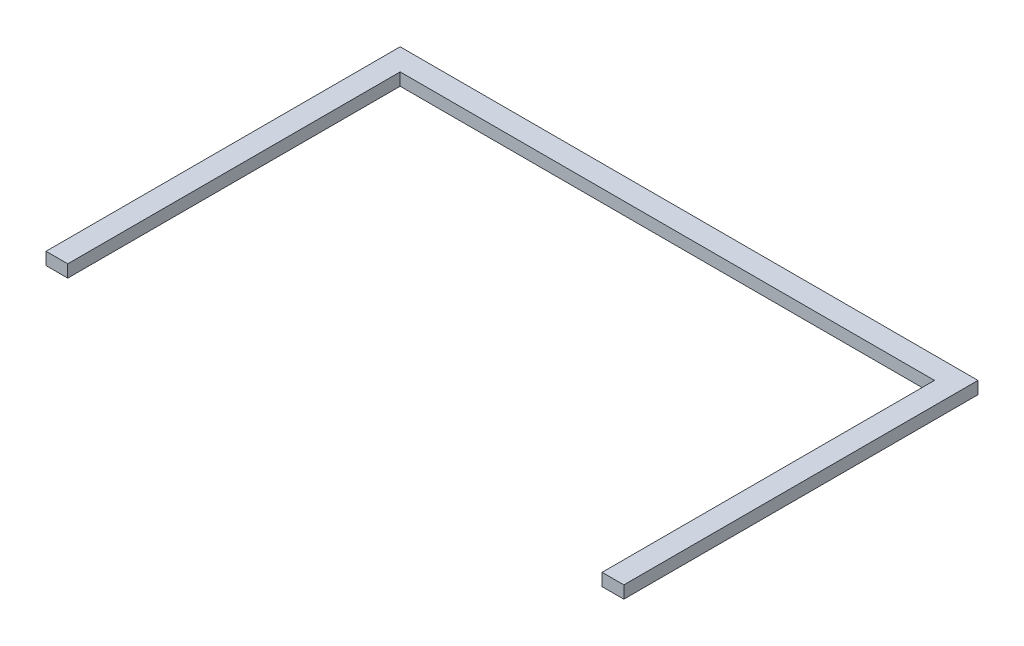
ISO-10303-21;
HEADER;
FILE_DESCRIPTION(('STEP AP214'),'2;1');
FILE_NAME('part.step','',(''),(''),'','','');
FILE_SCHEMA(('AUTOMOTIVE_DESIGN { 1 0 10303 214 1 1 1 1 }'));
ENDSEC;
DATA;
#1=APPLICATION_CONTEXT('core data for automotive mechanical design processes');
#2=APPLICATION_PROTOCOL_DEFINITION('international standard','automotive_design',2000,#1);
#3=PRODUCT_CONTEXT('',#1,'mechanical');
#4=PRODUCT('Part','Part','',(#3));
#5=PRODUCT_RELATED_PRODUCT_CATEGORY('part','',(#4));
#6=PRODUCT_DEFINITION_FORMATION('','',#4);
#7=PRODUCT_DEFINITION_CONTEXT('part definition',#1,'design');
#8=PRODUCT_DEFINITION('design','',#6,#7);
#9=PRODUCT_DEFINITION_SHAPE('','',#8);
#10=(LENGTH_UNIT() NAMED_UNIT(*) SI_UNIT(.MILLI.,.METRE.));
#11=(NAMED_UNIT(*) PLANE_ANGLE_UNIT() SI_UNIT($,.RADIAN.));
#12=(NAMED_UNIT(*) SI_UNIT($,.STERADIAN.) SOLID_ANGLE_UNIT());
#13=UNCERTAINTY_MEASURE_WITH_UNIT(LENGTH_MEASURE(1.E-05),#10,'distance_accuracy_value','');
#14=(GEOMETRIC_REPRESENTATION_CONTEXT(3) GLOBAL_UNCERTAINTY_ASSIGNED_CONTEXT((#13)) GLOBAL_UNIT_ASSIGNED_CONTEXT((#10,
#11,#12)) REPRESENTATION_CONTEXT('',''));
#15=CARTESIAN_POINT('',(0.,0.,0.));
#16=DIRECTION('',(0.,0.,1.));
#17=DIRECTION('',(1.,0.,0.));
#18=AXIS2_PLACEMENT_3D('',#15,#16,#17);
#19=CARTESIAN_POINT('',(93.,-167.491093751232,-261.));
#20=DIRECTION('',(1.,0.,0.));
#21=DIRECTION('',(0.,0.,-1.));
#22=AXIS2_PLACEMENT_3D('',#19,#20,#21);
#23=PLANE('',#22);
#24=DIRECTION('',(0.,1.,0.));
#25=VECTOR('',#24,1.);
#26=CARTESIAN_POINT('',(93.,-167.491093751232,-261.));
#27=LINE('',#26,#25);
#28=CARTESIAN_POINT('',(93.,-171.491093751232,-261.));
#29=VERTEX_POINT('',#28);
#30=CARTESIAN_POINT('',(93.,-167.491093751232,-261.));
#31=VERTEX_POINT('',#30);
#32=EDGE_CURVE('E11',#29,#31,#27,.T.);
#33=ORIENTED_EDGE('',*,*,#32,.F.);
#34=DIRECTION('',(0.,0.,1.));
#35=VECTOR('',#34,1.);
#36=CARTESIAN_POINT('',(93.,-171.491093751232,0.));
#37=LINE('',#36,#35);
#38=CARTESIAN_POINT('',(93.,-171.491093751232,-375.));
#39=VERTEX_POINT('',#38);
#40=EDGE_CURVE('E104',#29,#39,#37,.F.);
#41=ORIENTED_EDGE('',*,*,#40,.T.);
#42=DIRECTION('',(0.,1.,0.));
#43=VECTOR('',#42,1.);
#44=CARTESIAN_POINT('',(93.,-167.491093751232,-375.));
#45=LINE('',#44,#43);
#46=CARTESIAN_POINT('',(93.,-167.491093751232,-375.));
#47=VERTEX_POINT('',#46);
#48=EDGE_CURVE('E47',#39,#47,#45,.T.);
#49=ORIENTED_EDGE('',*,*,#48,.T.);
#50=DIRECTION('',(0.,0.,-1.));
#51=VECTOR('',#50,1.);
#52=CARTESIAN_POINT('',(93.,-167.491093751232,-261.));
#53=LINE('',#52,#51);
#54=EDGE_CURVE('E143',#31,#47,#53,.T.);
#55=ORIENTED_EDGE('',*,*,#54,.F.);
#56=EDGE_LOOP('',(#33,#41,#49,#55));
#57=FACE_BOUND('',#56,.T.);
#58=ADVANCED_FACE('F37',(#57),#23,.T.);
#59=CARTESIAN_POINT('',(93.,-167.491093751232,-375.));
#60=DIRECTION('',(0.,0.,-1.));
#61=DIRECTION('',(-1.,0.,0.));
#62=AXIS2_PLACEMENT_3D('',#59,#60,#61);
#63=PLANE('',#62);
#64=ORIENTED_EDGE('',*,*,#48,.F.);
#65=DIRECTION('',(1.,0.,0.));
#66=VECTOR('',#65,1.);
#67=CARTESIAN_POINT('',(0.,-171.491093751232,-375.));
#68=LINE('',#67,#66);
#69=CARTESIAN_POINT('',(-93.0000000000001,-171.491093751232,-375.));
#70=VERTEX_POINT('',#69);
#71=EDGE_CURVE('E123',#39,#70,#68,.F.);
#72=ORIENTED_EDGE('',*,*,#71,.T.);
#73=DIRECTION('',(0.,1.,0.));
#74=VECTOR('',#73,1.);
#75=CARTESIAN_POINT('',(-93.0000000000001,-167.491093751232,-375.));
#76=LINE('',#75,#74);
#77=CARTESIAN_POINT('',(-93.0000000000001,-167.491093751232,-375.));
#78=VERTEX_POINT('',#77);
#79=EDGE_CURVE('E136',#70,#78,#76,.T.);
#80=ORIENTED_EDGE('',*,*,#79,.T.);
#81=DIRECTION('',(-1.,0.,0.));
#82=VECTOR('',#81,1.);
#83=CARTESIAN_POINT('',(93.,-167.491093751232,-375.));
#84=LINE('',#83,#82);
#85=EDGE_CURVE('E152',#47,#78,#84,.T.);
#86=ORIENTED_EDGE('',*,*,#85,.F.);
#87=EDGE_LOOP('',(#64,#72,#80,#86));
#88=FACE_BOUND('',#87,.T.);
#89=ADVANCED_FACE('F155',(#88),#63,.T.);
#90=CARTESIAN_POINT('',(-93.0000000000001,-167.491093751232,-375.));
#91=DIRECTION('',(-1.,0.,0.));
#92=DIRECTION('',(0.,0.,1.));
#93=AXIS2_PLACEMENT_3D('',#90,#91,#92);
#94=PLANE('',#93);
#95=ORIENTED_EDGE('',*,*,#79,.F.);
#96=DIRECTION('',(0.,0.,1.));
#97=VECTOR('',#96,1.);
#98=CARTESIAN_POINT('',(-93.0000000000001,-171.491093751232,0.));
#99=LINE('',#98,#97);
#100=CARTESIAN_POINT('',(-93.,-171.491093751232,-261.));
#101=VERTEX_POINT('',#100);
#102=EDGE_CURVE('E120',#70,#101,#99,.T.);
#103=ORIENTED_EDGE('',*,*,#102,.T.);
#104=DIRECTION('',(0.,1.,0.));
#105=VECTOR('',#104,1.);
#106=CARTESIAN_POINT('',(-93.,-167.491093751232,-261.));
#107=LINE('',#106,#105);
#108=CARTESIAN_POINT('',(-93.,-167.491093751232,-261.));
#109=VERTEX_POINT('',#108);
#110=EDGE_CURVE('E133',#101,#109,#107,.T.);
#111=ORIENTED_EDGE('',*,*,#110,.T.);
#112=DIRECTION('',(0.,0.,1.));
#113=VECTOR('',#112,1.);
#114=CARTESIAN_POINT('',(-93.0000000000001,-167.491093751232,-375.));
#115=LINE('',#114,#113);
#116=EDGE_CURVE('E156',#78,#109,#115,.T.);
#117=ORIENTED_EDGE('',*,*,#116,.F.);
#118=EDGE_LOOP('',(#95,#103,#111,#117));
#119=FACE_BOUND('',#118,.T.);
#120=ADVANCED_FACE('F178',(#119),#94,.T.);
#121=CARTESIAN_POINT('',(-93.,-167.491093751232,-261.));
#122=DIRECTION('',(0.,0.,1.));
#123=DIRECTION('',(1.,0.,0.));
#124=AXIS2_PLACEMENT_3D('',#121,#122,#123);
#125=PLANE('',#124);
#126=ORIENTED_EDGE('',*,*,#110,.F.);
#127=DIRECTION('',(1.,0.,0.));
#128=VECTOR('',#127,1.);
#129=CARTESIAN_POINT('',(0.,-171.491093751232,-261.));
#130=LINE('',#129,#128);
#131=CARTESIAN_POINT('',(-86.,-171.491093751232,-261.));
#132=VERTEX_POINT('',#131);
#133=EDGE_CURVE('E117',#101,#132,#130,.T.);
#134=ORIENTED_EDGE('',*,*,#133,.T.);
#135=DIRECTION('',(0.,1.,0.));
#136=VECTOR('',#135,1.);
#137=CARTESIAN_POINT('',(-86.,-167.491093751232,-261.));
#138=LINE('',#137,#136);
#139=CARTESIAN_POINT('',(-86.,-167.491093751232,-261.));
#140=VERTEX_POINT('',#139);
#141=EDGE_CURVE('E130',#132,#140,#138,.T.);
#142=ORIENTED_EDGE('',*,*,#141,.T.);
#143=DIRECTION('',(1.,0.,0.));
#144=VECTOR('',#143,1.);
#145=CARTESIAN_POINT('',(-93.,-167.491093751232,-261.));
#146=LINE('',#145,#144);
#147=EDGE_CURVE('E158',#109,#140,#146,.T.);
#148=ORIENTED_EDGE('',*,*,#147,.F.);
#149=EDGE_LOOP('',(#126,#134,#142,#148));
#150=FACE_BOUND('',#149,.T.);
#151=ADVANCED_FACE('F174',(#150),#125,.T.);
#152=CARTESIAN_POINT('',(-86.,-167.491093751232,-261.));
#153=DIRECTION('',(1.,0.,0.));
#154=DIRECTION('',(0.,0.,-1.));
#155=AXIS2_PLACEMENT_3D('',#152,#153,#154);
#156=PLANE('',#155);
#157=ORIENTED_EDGE('',*,*,#141,.F.);
#158=DIRECTION('',(0.,0.,1.));
#159=VECTOR('',#158,1.);
#160=CARTESIAN_POINT('',(-86.,-171.491093751232,0.));
#161=LINE('',#160,#159);
#162=CARTESIAN_POINT('',(-86.,-171.491093751232,-368.));
#163=VERTEX_POINT('',#162);
#164=EDGE_CURVE('E114',#132,#163,#161,.F.);
#165=ORIENTED_EDGE('',*,*,#164,.T.);
#166=DIRECTION('',(0.,1.,0.));
#167=VECTOR('',#166,1.);
#168=CARTESIAN_POINT('',(-86.,-167.491093751232,-368.));
#169=LINE('',#168,#167);
#170=CARTESIAN_POINT('',(-86.,-167.491093751232,-368.));
#171=VERTEX_POINT('',#170);
#172=EDGE_CURVE('E128',#163,#171,#169,.T.);
#173=ORIENTED_EDGE('',*,*,#172,.T.);
#174=DIRECTION('',(0.,0.,-1.));
#175=VECTOR('',#174,1.);
#176=CARTESIAN_POINT('',(-86.,-167.491093751232,-261.));
#177=LINE('',#176,#175);
#178=EDGE_CURVE('E163',#140,#171,#177,.T.);
#179=ORIENTED_EDGE('',*,*,#178,.F.);
#180=EDGE_LOOP('',(#157,#165,#173,#179));
#181=FACE_BOUND('',#180,.T.);
#182=ADVANCED_FACE('F170',(#181),#156,.T.);
#183=CARTESIAN_POINT('',(-86.,-167.491093751232,-368.));
#184=DIRECTION('',(0.,0.,1.));
#185=DIRECTION('',(1.,0.,0.));
#186=AXIS2_PLACEMENT_3D('',#183,#184,#185);
#187=PLANE('',#186);
#188=ORIENTED_EDGE('',*,*,#172,.F.);
#189=DIRECTION('',(1.,0.,0.));
#190=VECTOR('',#189,1.);
#191=CARTESIAN_POINT('',(0.,-171.491093751232,-368.));
#192=LINE('',#191,#190);
#193=CARTESIAN_POINT('',(86.,-171.491093751232,-368.));
#194=VERTEX_POINT('',#193);
#195=EDGE_CURVE('E111',#163,#194,#192,.T.);
#196=ORIENTED_EDGE('',*,*,#195,.T.);
#197=DIRECTION('',(0.,1.,0.));
#198=VECTOR('',#197,1.);
#199=CARTESIAN_POINT('',(86.,-167.491093751232,-368.));
#200=LINE('',#199,#198);
#201=CARTESIAN_POINT('',(86.,-167.491093751232,-368.));
#202=VERTEX_POINT('',#201);
#203=EDGE_CURVE('E55',#194,#202,#200,.T.);
#204=ORIENTED_EDGE('',*,*,#203,.T.);
#205=DIRECTION('',(1.,0.,0.));
#206=VECTOR('',#205,1.);
#207=CARTESIAN_POINT('',(-86.,-167.491093751232,-368.));
#208=LINE('',#207,#206);
#209=EDGE_CURVE('E97',#171,#202,#208,.T.);
#210=ORIENTED_EDGE('',*,*,#209,.F.);
#211=EDGE_LOOP('',(#188,#196,#204,#210));
#212=FACE_BOUND('',#211,.T.);
#213=ADVANCED_FACE('F167',(#212),#187,.T.);
#214=CARTESIAN_POINT('',(86.,-167.491093751232,-368.));
#215=DIRECTION('',(-1.,0.,0.));
#216=DIRECTION('',(0.,0.,1.));
#217=AXIS2_PLACEMENT_3D('',#214,#215,#216);
#218=PLANE('',#217);
#219=ORIENTED_EDGE('',*,*,#203,.F.);
#220=DIRECTION('',(0.,0.,1.));
#221=VECTOR('',#220,1.);
#222=CARTESIAN_POINT('',(86.,-171.491093751232,0.));
#223=LINE('',#222,#221);
#224=CARTESIAN_POINT('',(86.,-171.491093751232,-261.));
#225=VERTEX_POINT('',#224);
#226=EDGE_CURVE('E102',#194,#225,#223,.T.);
#227=ORIENTED_EDGE('',*,*,#226,.T.);
#228=DIRECTION('',(0.,1.,0.));
#229=VECTOR('',#228,1.);
#230=CARTESIAN_POINT('',(86.,-167.491093751232,-261.));
#231=LINE('',#230,#229);
#232=CARTESIAN_POINT('',(86.,-167.491093751232,-261.));
#233=VERTEX_POINT('',#232);
#234=EDGE_CURVE('E41',#225,#233,#231,.T.);
#235=ORIENTED_EDGE('',*,*,#234,.T.);
#236=DIRECTION('',(0.,0.,1.));
#237=VECTOR('',#236,1.);
#238=CARTESIAN_POINT('',(86.,-167.491093751232,-368.));
#239=LINE('',#238,#237);
#240=EDGE_CURVE('E113',#202,#233,#239,.T.);
#241=ORIENTED_EDGE('',*,*,#240,.F.);
#242=EDGE_LOOP('',(#219,#227,#235,#241));
#243=FACE_BOUND('',#242,.T.);
#244=ADVANCED_FACE('F106',(#243),#218,.T.);
#245=CARTESIAN_POINT('',(86.,-167.491093751232,-261.));
#246=DIRECTION('',(0.,0.,1.));
#247=DIRECTION('',(1.,0.,0.));
#248=AXIS2_PLACEMENT_3D('',#245,#246,#247);
#249=PLANE('',#248);
#250=DIRECTION('',(1.,0.,0.));
#251=VECTOR('',#250,1.);
#252=CARTESIAN_POINT('',(0.,-171.491093751232,-261.));
#253=LINE('',#252,#251);
#254=EDGE_CURVE('E91',#225,#29,#253,.T.);
#255=ORIENTED_EDGE('',*,*,#254,.T.);
#256=ORIENTED_EDGE('',*,*,#32,.T.);
#257=DIRECTION('',(1.,0.,0.));
#258=VECTOR('',#257,1.);
#259=CARTESIAN_POINT('',(86.,-167.491093751232,-261.));
#260=LINE('',#259,#258);
#261=EDGE_CURVE('E93',#233,#31,#260,.T.);
#262=ORIENTED_EDGE('',*,*,#261,.F.);
#263=ORIENTED_EDGE('',*,*,#234,.F.);
#264=EDGE_LOOP('',(#255,#256,#262,#263));
#265=FACE_BOUND('',#264,.T.);
#266=ADVANCED_FACE('F39',(#265),#249,.T.);
#267=CARTESIAN_POINT('',(0.,-167.491093751232,0.));
#268=DIRECTION('',(0.,1.,0.));
#269=DIRECTION('',(0.,0.,1.));
#270=AXIS2_PLACEMENT_3D('',#267,#268,#269);
#271=PLANE('',#270);
#272=ORIENTED_EDGE('',*,*,#240,.T.);
#273=ORIENTED_EDGE('',*,*,#261,.T.);
#274=ORIENTED_EDGE('',*,*,#54,.T.);
#275=ORIENTED_EDGE('',*,*,#85,.T.);
#276=ORIENTED_EDGE('',*,*,#116,.T.);
#277=ORIENTED_EDGE('',*,*,#147,.T.);
#278=ORIENTED_EDGE('',*,*,#178,.T.);
#279=ORIENTED_EDGE('',*,*,#209,.T.);
#280=EDGE_LOOP('',(#272,#273,#274,#275,#276,#277,#278,#279));
#281=FACE_BOUND('',#280,.T.);
#282=ADVANCED_FACE('F150',(#281),#271,.T.);
#283=CARTESIAN_POINT('',(0.,-171.491093751232,0.));
#284=DIRECTION('',(0.,1.,0.));
#285=DIRECTION('',(0.,0.,1.));
#286=AXIS2_PLACEMENT_3D('',#283,#284,#285);
#287=PLANE('',#286);
#288=ORIENTED_EDGE('',*,*,#226,.F.);
#289=ORIENTED_EDGE('',*,*,#195,.F.);
#290=ORIENTED_EDGE('',*,*,#164,.F.);
#291=ORIENTED_EDGE('',*,*,#133,.F.);
#292=ORIENTED_EDGE('',*,*,#102,.F.);
#293=ORIENTED_EDGE('',*,*,#71,.F.);
#294=ORIENTED_EDGE('',*,*,#40,.F.);
#295=ORIENTED_EDGE('',*,*,#254,.F.);
#296=EDGE_LOOP('',(#288,#289,#290,#291,#292,#293,#294,#295));
#297=FACE_BOUND('',#296,.T.);
#298=ADVANCED_FACE('F100',(#297),#287,.F.);
#299=CLOSED_SHELL('',(#58,#89,#120,#151,#182,#213,#244,#266,#282,#298));
#300=MANIFOLD_SOLID_BREP('B2',#299);
#301=ADVANCED_BREP_SHAPE_REPRESENTATION('',(#18,#300),#14);
#302=SHAPE_DEFINITION_REPRESENTATION(#9,#301);
ENDSEC;
END-ISO-10303-21;
